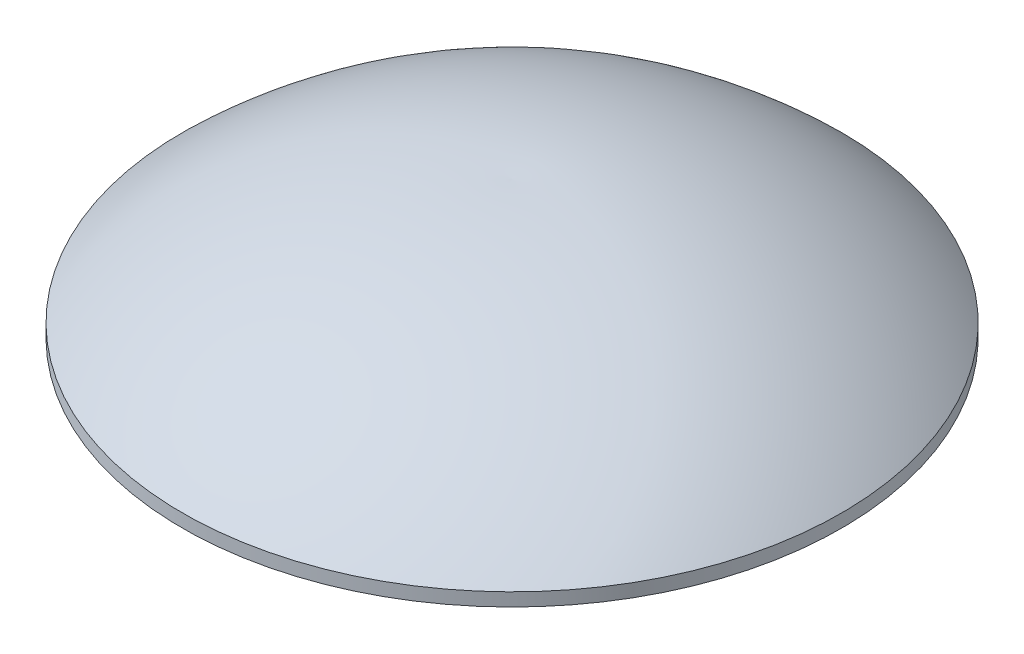
ISO-10303-21;
HEADER;
FILE_DESCRIPTION(('STEP AP214'),'2;1');
FILE_NAME('part.step','',(''),(''),'','','');
FILE_SCHEMA(('AUTOMOTIVE_DESIGN { 1 0 10303 214 1 1 1 1 }'));
ENDSEC;
DATA;
#1=APPLICATION_CONTEXT('core data for automotive mechanical design processes');
#2=APPLICATION_PROTOCOL_DEFINITION('international standard','automotive_design',2000,#1);
#3=PRODUCT_CONTEXT('',#1,'mechanical');
#4=PRODUCT('Part','Part','',(#3));
#5=PRODUCT_RELATED_PRODUCT_CATEGORY('part','',(#4));
#6=PRODUCT_DEFINITION_FORMATION('','',#4);
#7=PRODUCT_DEFINITION_CONTEXT('part definition',#1,'design');
#8=PRODUCT_DEFINITION('design','',#6,#7);
#9=PRODUCT_DEFINITION_SHAPE('','',#8);
#10=(LENGTH_UNIT() NAMED_UNIT(*) SI_UNIT(.MILLI.,.METRE.));
#11=(NAMED_UNIT(*) PLANE_ANGLE_UNIT() SI_UNIT($,.RADIAN.));
#12=(NAMED_UNIT(*) SI_UNIT($,.STERADIAN.) SOLID_ANGLE_UNIT());
#13=UNCERTAINTY_MEASURE_WITH_UNIT(LENGTH_MEASURE(1.E-05),#10,'distance_accuracy_value','');
#14=(GEOMETRIC_REPRESENTATION_CONTEXT(3) GLOBAL_UNCERTAINTY_ASSIGNED_CONTEXT((#13)) GLOBAL_UNIT_ASSIGNED_CONTEXT((#10,
#11,#12)) REPRESENTATION_CONTEXT('',''));
#15=CARTESIAN_POINT('',(0.,0.,0.));
#16=DIRECTION('',(0.,0.,1.));
#17=DIRECTION('',(1.,0.,0.));
#18=AXIS2_PLACEMENT_3D('',#15,#16,#17);
#19=CARTESIAN_POINT('',(0.,-2.39913478904597,-0.124631321936949));
#20=DIRECTION('',(-1.,0.,0.));
#21=DIRECTION('',(0.,0.,-1.));
#22=AXIS2_PLACEMENT_3D('',#19,#20,#21);
#23=CIRCLE('',#22,3.44790531345379);
#24=TRIMMED_CURVE('',#23,(PARAMETER_VALUE(-1.60695117073344)),
(PARAMETER_VALUE(1.60695117073344)),.T.,.PARAMETER.);
#25=CARTESIAN_POINT('',(0.,-2.39913478904597,0.));
#26=DIRECTION('',(0.,-1.,0.));
#27=AXIS1_PLACEMENT('',#25,#26);
#28=SURFACE_OF_REVOLUTION('',#24,#27);
#29=CARTESIAN_POINT('',(0.,0.1,0.));
#30=DIRECTION('',(0.,-1.,0.));
#31=DIRECTION('',(0.,0.,-1.));
#32=AXIS2_PLACEMENT_3D('',#29,#30,#31);
#33=CIRCLE('',#32,2.5);
#34=CARTESIAN_POINT('',(0.,0.1,-2.5));
#35=VERTEX_POINT('',#34);
#36=EDGE_CURVE('E38',#35,#35,#33,.T.);
#37=ORIENTED_EDGE('',*,*,#36,.F.);
#38=EDGE_LOOP('',(#37));
#39=FACE_BOUND('',#38,.T.);
#40=CARTESIAN_POINT('',(0.,1.04651726595539,0.));
#41=VERTEX_POINT('',#40);
#42=VERTEX_LOOP('',#41);
#43=FACE_BOUND('',#42,.T.);
#44=ADVANCED_FACE('F32',(#39,#43),#28,.T.);
#45=CARTESIAN_POINT('',(-2.5,0.,0.));
#46=DIRECTION('',(0.,1.,0.));
#47=DIRECTION('',(0.,0.,1.));
#48=AXIS2_PLACEMENT_3D('',#45,#46,#47);
#49=PLANE('',#48);
#50=CARTESIAN_POINT('',(0.,0.,0.));
#51=DIRECTION('',(0.,-1.,0.));
#52=DIRECTION('',(0.,0.,-1.));
#53=AXIS2_PLACEMENT_3D('',#50,#51,#52);
#54=CIRCLE('',#53,2.5);
#55=CARTESIAN_POINT('',(0.,0.,-2.5));
#56=VERTEX_POINT('',#55);
#57=EDGE_CURVE('E11',#56,#56,#54,.T.);
#58=ORIENTED_EDGE('',*,*,#57,.T.);
#59=EDGE_LOOP('',(#58));
#60=FACE_BOUND('',#59,.T.);
#61=ADVANCED_FACE('F42',(#60),#49,.F.);
#62=CARTESIAN_POINT('',(0.,-0.535647926218466,0.));
#63=DIRECTION('',(0.,-1.,0.));
#64=DIRECTION('',(0.,0.,-1.));
#65=AXIS2_PLACEMENT_3D('',#62,#63,#64);
#66=CYLINDRICAL_SURFACE('',#65,2.5);
#67=ORIENTED_EDGE('',*,*,#57,.F.);
#68=EDGE_LOOP('',(#67));
#69=FACE_BOUND('',#68,.T.);
#70=ORIENTED_EDGE('',*,*,#36,.T.);
#71=EDGE_LOOP('',(#70));
#72=FACE_BOUND('',#71,.T.);
#73=ADVANCED_FACE('F47',(#69,#72),#66,.T.);
#74=CLOSED_SHELL('',(#44,#61,#73));
#75=MANIFOLD_SOLID_BREP('B2',#74);
#76=ADVANCED_BREP_SHAPE_REPRESENTATION('',(#18,#75),#14);
#77=SHAPE_DEFINITION_REPRESENTATION(#9,#76);
ENDSEC;
END-ISO-10303-21;
